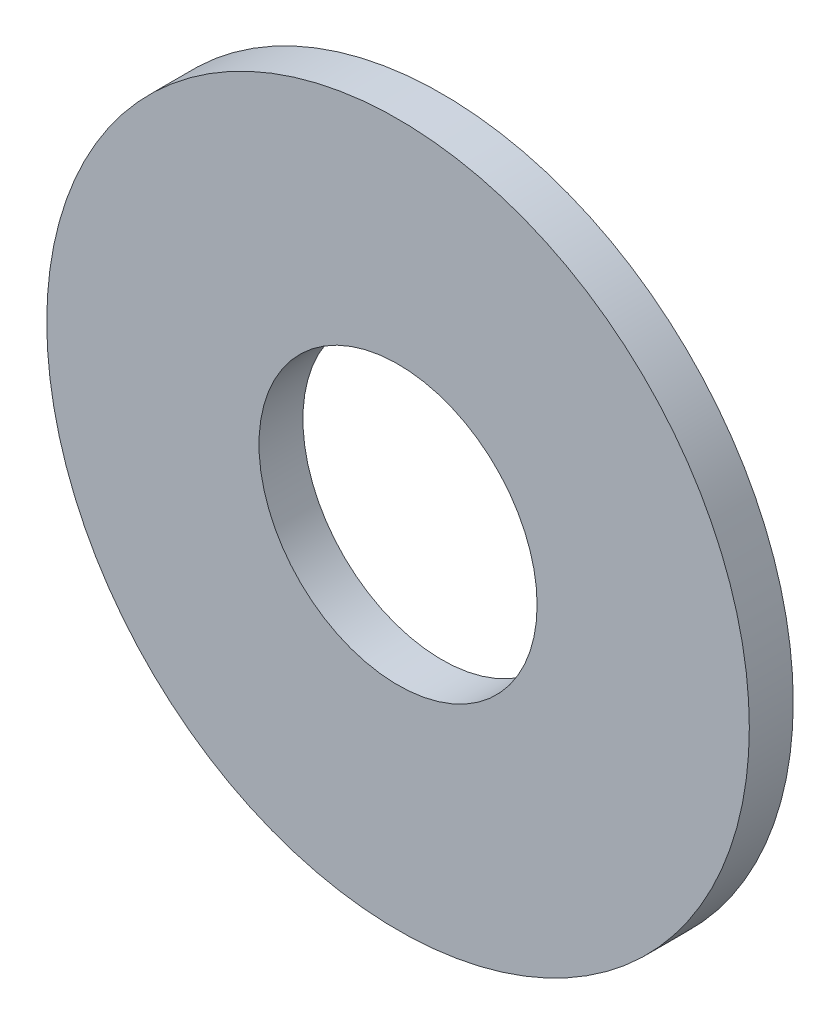
ISO-10303-21;
HEADER;
FILE_DESCRIPTION(('STEP AP214'),'2;1');
FILE_NAME('part.step','',(''),(''),'','','');
FILE_SCHEMA(('AUTOMOTIVE_DESIGN { 1 0 10303 214 1 1 1 1 }'));
ENDSEC;
DATA;
#1=APPLICATION_CONTEXT('core data for automotive mechanical design processes');
#2=APPLICATION_PROTOCOL_DEFINITION('international standard','automotive_design',2000,#1);
#3=PRODUCT_CONTEXT('',#1,'mechanical');
#4=PRODUCT('Part','Part','',(#3));
#5=PRODUCT_RELATED_PRODUCT_CATEGORY('part','',(#4));
#6=PRODUCT_DEFINITION_FORMATION('','',#4);
#7=PRODUCT_DEFINITION_CONTEXT('part definition',#1,'design');
#8=PRODUCT_DEFINITION('design','',#6,#7);
#9=PRODUCT_DEFINITION_SHAPE('','',#8);
#10=(LENGTH_UNIT() NAMED_UNIT(*) SI_UNIT(.MILLI.,.METRE.));
#11=(NAMED_UNIT(*) PLANE_ANGLE_UNIT() SI_UNIT($,.RADIAN.));
#12=(NAMED_UNIT(*) SI_UNIT($,.STERADIAN.) SOLID_ANGLE_UNIT());
#13=UNCERTAINTY_MEASURE_WITH_UNIT(LENGTH_MEASURE(1.E-05),#10,'distance_accuracy_value','');
#14=(GEOMETRIC_REPRESENTATION_CONTEXT(3) GLOBAL_UNCERTAINTY_ASSIGNED_CONTEXT((#13)) GLOBAL_UNIT_ASSIGNED_CONTEXT((#10,
#11,#12)) REPRESENTATION_CONTEXT('',''));
#15=CARTESIAN_POINT('',(0.,0.,0.));
#16=DIRECTION('',(0.,0.,1.));
#17=DIRECTION('',(1.,0.,0.));
#18=AXIS2_PLACEMENT_3D('',#15,#16,#17);
#19=CARTESIAN_POINT('',(0.,0.,-3.));
#20=DIRECTION('',(0.,0.,1.));
#21=DIRECTION('',(1.,0.,0.));
#22=AXIS2_PLACEMENT_3D('',#19,#20,#21);
#23=CYLINDRICAL_SURFACE('',#22,24.);
#24=CARTESIAN_POINT('',(0.,0.,-3.));
#25=DIRECTION('',(0.,0.,1.));
#26=DIRECTION('',(1.,0.,0.));
#27=AXIS2_PLACEMENT_3D('',#24,#25,#26);
#28=CIRCLE('',#27,24.);
#29=CARTESIAN_POINT('',(24.,0.,-3.));
#30=VERTEX_POINT('',#29);
#31=EDGE_CURVE('E12',#30,#30,#28,.T.);
#32=ORIENTED_EDGE('',*,*,#31,.T.);
#33=EDGE_LOOP('',(#32));
#34=FACE_BOUND('',#33,.T.);
#35=CARTESIAN_POINT('',(0.,0.,0.));
#36=DIRECTION('',(0.,0.,1.));
#37=DIRECTION('',(1.,0.,0.));
#38=AXIS2_PLACEMENT_3D('',#35,#36,#37);
#39=CIRCLE('',#38,24.);
#40=CARTESIAN_POINT('',(24.,0.,0.));
#41=VERTEX_POINT('',#40);
#42=EDGE_CURVE('E49',#41,#41,#39,.T.);
#43=ORIENTED_EDGE('',*,*,#42,.F.);
#44=EDGE_LOOP('',(#43));
#45=FACE_BOUND('',#44,.T.);
#46=ADVANCED_FACE('F46',(#34,#45),#23,.T.);
#47=CARTESIAN_POINT('',(0.,0.,-3.));
#48=DIRECTION('',(0.,0.,1.));
#49=DIRECTION('',(1.,0.,0.));
#50=AXIS2_PLACEMENT_3D('',#47,#48,#49);
#51=PLANE('',#50);
#52=CARTESIAN_POINT('',(0.,0.,-3.));
#53=DIRECTION('',(0.,0.,1.));
#54=DIRECTION('',(1.,0.,0.));
#55=AXIS2_PLACEMENT_3D('',#52,#53,#54);
#56=CIRCLE('',#55,9.5);
#57=CARTESIAN_POINT('',(9.5,0.,-3.));
#58=VERTEX_POINT('',#57);
#59=EDGE_CURVE('E56',#58,#58,#56,.F.);
#60=ORIENTED_EDGE('',*,*,#59,.F.);
#61=EDGE_LOOP('',(#60));
#62=FACE_BOUND('',#61,.T.);
#63=ORIENTED_EDGE('',*,*,#31,.F.);
#64=EDGE_LOOP('',(#63));
#65=FACE_BOUND('',#64,.T.);
#66=ADVANCED_FACE('F70',(#62,#65),#51,.F.);
#67=CARTESIAN_POINT('',(0.,0.,0.));
#68=DIRECTION('',(0.,0.,1.));
#69=DIRECTION('',(1.,0.,0.));
#70=AXIS2_PLACEMENT_3D('',#67,#68,#69);
#71=PLANE('',#70);
#72=CARTESIAN_POINT('',(0.,0.,0.));
#73=DIRECTION('',(0.,0.,1.));
#74=DIRECTION('',(1.,0.,0.));
#75=AXIS2_PLACEMENT_3D('',#72,#73,#74);
#76=CIRCLE('',#75,9.5);
#77=CARTESIAN_POINT('',(9.5,0.,0.));
#78=VERTEX_POINT('',#77);
#79=EDGE_CURVE('E60',#78,#78,#76,.T.);
#80=ORIENTED_EDGE('',*,*,#79,.F.);
#81=EDGE_LOOP('',(#80));
#82=FACE_BOUND('',#81,.T.);
#83=ORIENTED_EDGE('',*,*,#42,.T.);
#84=EDGE_LOOP('',(#83));
#85=FACE_BOUND('',#84,.T.);
#86=ADVANCED_FACE('F67',(#82,#85),#71,.T.);
#87=CARTESIAN_POINT('',(0.,0.,-3.001));
#88=DIRECTION('',(0.,0.,1.));
#89=DIRECTION('',(1.,0.,0.));
#90=AXIS2_PLACEMENT_3D('',#87,#88,#89);
#91=CYLINDRICAL_SURFACE('',#90,9.5);
#92=ORIENTED_EDGE('',*,*,#79,.T.);
#93=EDGE_LOOP('',(#92));
#94=FACE_BOUND('',#93,.T.);
#95=ORIENTED_EDGE('',*,*,#59,.T.);
#96=EDGE_LOOP('',(#95));
#97=FACE_BOUND('',#96,.T.);
#98=ADVANCED_FACE('F64',(#94,#97),#91,.F.);
#99=CLOSED_SHELL('',(#46,#66,#86,#98));
#100=MANIFOLD_SOLID_BREP('B2',#99);
#101=ADVANCED_BREP_SHAPE_REPRESENTATION('',(#18,#100),#14);
#102=SHAPE_DEFINITION_REPRESENTATION(#9,#101);
ENDSEC;
END-ISO-10303-21;
